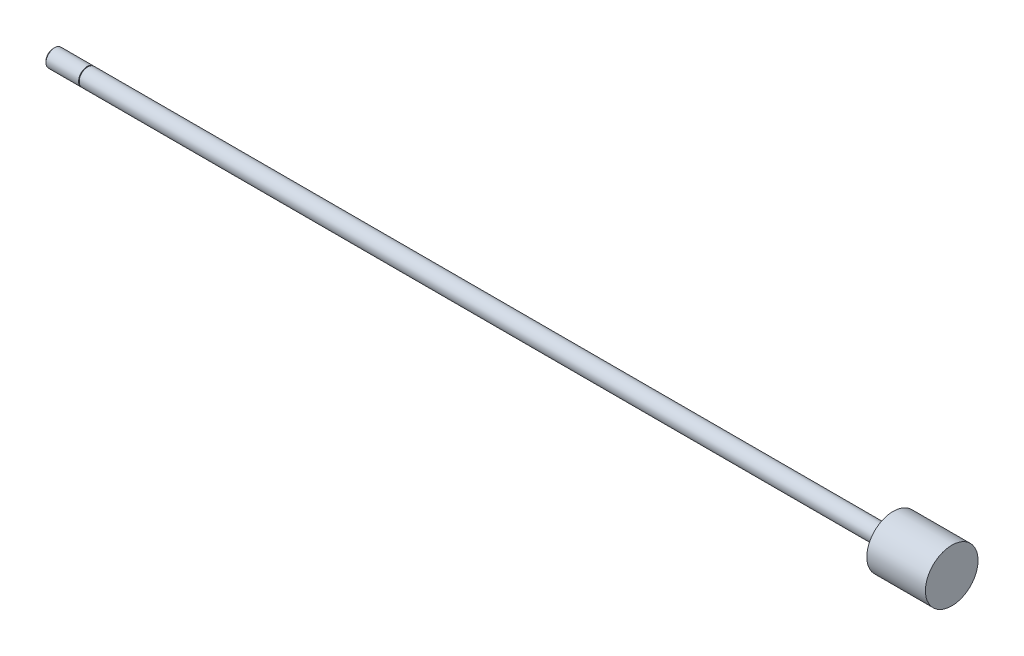
ISO-10303-21;
HEADER;
FILE_DESCRIPTION(('STEP AP214'),'2;1');
FILE_NAME('part.step','',(''),(''),'','','');
FILE_SCHEMA(('AUTOMOTIVE_DESIGN { 1 0 10303 214 1 1 1 1 }'));
ENDSEC;
DATA;
#1=APPLICATION_CONTEXT('core data for automotive mechanical design processes');
#2=APPLICATION_PROTOCOL_DEFINITION('international standard','automotive_design',2000,#1);
#3=PRODUCT_CONTEXT('',#1,'mechanical');
#4=PRODUCT('Part','Part','',(#3));
#5=PRODUCT_RELATED_PRODUCT_CATEGORY('part','',(#4));
#6=PRODUCT_DEFINITION_FORMATION('','',#4);
#7=PRODUCT_DEFINITION_CONTEXT('part definition',#1,'design');
#8=PRODUCT_DEFINITION('design','',#6,#7);
#9=PRODUCT_DEFINITION_SHAPE('','',#8);
#10=(LENGTH_UNIT() NAMED_UNIT(*) SI_UNIT(.MILLI.,.METRE.));
#11=(NAMED_UNIT(*) PLANE_ANGLE_UNIT() SI_UNIT($,.RADIAN.));
#12=(NAMED_UNIT(*) SI_UNIT($,.STERADIAN.) SOLID_ANGLE_UNIT());
#13=UNCERTAINTY_MEASURE_WITH_UNIT(LENGTH_MEASURE(1.E-05),#10,'distance_accuracy_value','');
#14=(GEOMETRIC_REPRESENTATION_CONTEXT(3) GLOBAL_UNCERTAINTY_ASSIGNED_CONTEXT((#13)) GLOBAL_UNIT_ASSIGNED_CONTEXT((#10,
#11,#12)) REPRESENTATION_CONTEXT('',''));
#15=CARTESIAN_POINT('',(0.,0.,0.));
#16=DIRECTION('',(0.,0.,1.));
#17=DIRECTION('',(1.,0.,0.));
#18=AXIS2_PLACEMENT_3D('',#15,#16,#17);
#19=CARTESIAN_POINT('',(315.9252,0.,0.));
#20=DIRECTION('',(-1.,0.,0.));
#21=DIRECTION('',(0.,0.,1.));
#22=AXIS2_PLACEMENT_3D('',#19,#20,#21);
#23=CYLINDRICAL_SURFACE('',#22,3.175);
#24=CARTESIAN_POINT('',(294.4876,0.,0.));
#25=DIRECTION('',(-1.,0.,0.));
#26=DIRECTION('',(0.,0.,1.));
#27=AXIS2_PLACEMENT_3D('',#24,#25,#26);
#28=CIRCLE('',#27,3.175);
#29=CARTESIAN_POINT('',(294.4876,0.,3.175));
#30=VERTEX_POINT('',#29);
#31=EDGE_CURVE('E10',#30,#30,#28,.T.);
#32=ORIENTED_EDGE('',*,*,#31,.T.);
#33=EDGE_LOOP('',(#32));
#34=FACE_BOUND('',#33,.T.);
#35=CARTESIAN_POINT('',(0.,0.,0.));
#36=DIRECTION('',(-1.,0.,0.));
#37=DIRECTION('',(0.,0.,1.));
#38=AXIS2_PLACEMENT_3D('',#35,#36,#37);
#39=CIRCLE('',#38,3.175);
#40=CARTESIAN_POINT('',(0.,0.,3.175));
#41=VERTEX_POINT('',#40);
#42=EDGE_CURVE('E50',#41,#41,#39,.T.);
#43=ORIENTED_EDGE('',*,*,#42,.F.);
#44=EDGE_LOOP('',(#43));
#45=FACE_BOUND('',#44,.T.);
#46=ADVANCED_FACE('F34',(#34,#45),#23,.T.);
#47=CARTESIAN_POINT('',(294.4876,3.175,0.));
#48=DIRECTION('',(1.,0.,0.));
#49=DIRECTION('',(0.,0.,-1.));
#50=AXIS2_PLACEMENT_3D('',#47,#48,#49);
#51=PLANE('',#50);
#52=ORIENTED_EDGE('',*,*,#31,.F.);
#53=EDGE_LOOP('',(#52));
#54=FACE_BOUND('',#53,.T.);
#55=CARTESIAN_POINT('',(294.4876,0.,0.));
#56=DIRECTION('',(-1.,0.,0.));
#57=DIRECTION('',(0.,0.,1.));
#58=AXIS2_PLACEMENT_3D('',#55,#56,#57);
#59=CIRCLE('',#58,9.62025);
#60=CARTESIAN_POINT('',(294.4876,0.,9.62025));
#61=VERTEX_POINT('',#60);
#62=EDGE_CURVE('E42',#61,#61,#59,.T.);
#63=ORIENTED_EDGE('',*,*,#62,.T.);
#64=EDGE_LOOP('',(#63));
#65=FACE_BOUND('',#64,.T.);
#66=ADVANCED_FACE('F84',(#54,#65),#51,.F.);
#67=CARTESIAN_POINT('',(315.9252,0.,0.));
#68=DIRECTION('',(-1.,0.,0.));
#69=DIRECTION('',(0.,0.,1.));
#70=AXIS2_PLACEMENT_3D('',#67,#68,#69);
#71=CYLINDRICAL_SURFACE('',#70,9.62025);
#72=ORIENTED_EDGE('',*,*,#62,.F.);
#73=EDGE_LOOP('',(#72));
#74=FACE_BOUND('',#73,.T.);
#75=CARTESIAN_POINT('',(315.9252,0.,0.));
#76=DIRECTION('',(-1.,0.,0.));
#77=DIRECTION('',(0.,0.,1.));
#78=AXIS2_PLACEMENT_3D('',#75,#76,#77);
#79=CIRCLE('',#78,9.62025);
#80=CARTESIAN_POINT('',(315.9252,0.,9.62025));
#81=VERTEX_POINT('',#80);
#82=EDGE_CURVE('E47',#81,#81,#79,.T.);
#83=ORIENTED_EDGE('',*,*,#82,.T.);
#84=EDGE_LOOP('',(#83));
#85=FACE_BOUND('',#84,.T.);
#86=ADVANCED_FACE('F72',(#74,#85),#71,.T.);
#87=CARTESIAN_POINT('',(315.9252,9.62025,0.));
#88=DIRECTION('',(-1.,0.,0.));
#89=DIRECTION('',(0.,0.,1.));
#90=AXIS2_PLACEMENT_3D('',#87,#88,#89);
#91=PLANE('',#90);
#92=ORIENTED_EDGE('',*,*,#82,.F.);
#93=EDGE_LOOP('',(#92));
#94=FACE_BOUND('',#93,.T.);
#95=ADVANCED_FACE('F74',(#94),#91,.F.);
#96=CARTESIAN_POINT('',(-0.254,3.429,0.));
#97=DIRECTION('',(1.,0.,0.));
#98=DIRECTION('',(0.,0.,-1.));
#99=AXIS2_PLACEMENT_3D('',#96,#97,#98);
#100=PLANE('',#99);
#101=CARTESIAN_POINT('',(-0.254,0.,0.));
#102=DIRECTION('',(-1.,0.,0.));
#103=DIRECTION('',(0.,0.,1.));
#104=AXIS2_PLACEMENT_3D('',#101,#102,#103);
#105=CIRCLE('',#104,2.921);
#106=CARTESIAN_POINT('',(-0.254,0.,2.921));
#107=VERTEX_POINT('',#106);
#108=EDGE_CURVE('E52',#107,#107,#105,.T.);
#109=ORIENTED_EDGE('',*,*,#108,.T.);
#110=EDGE_LOOP('',(#109));
#111=FACE_BOUND('',#110,.T.);
#112=CARTESIAN_POINT('',(-0.253999999999976,0.,0.));
#113=DIRECTION('',(1.,0.,0.));
#114=DIRECTION('',(0.,0.,-1.));
#115=AXIS2_PLACEMENT_3D('',#112,#113,#114);
#116=CIRCLE('',#115,3.175);
#117=CARTESIAN_POINT('',(-0.253999999999976,0.,-3.175));
#118=VERTEX_POINT('',#117);
#119=EDGE_CURVE('E38',#118,#118,#116,.T.);
#120=ORIENTED_EDGE('',*,*,#119,.T.);
#121=EDGE_LOOP('',(#120));
#122=FACE_BOUND('',#121,.T.);
#123=ADVANCED_FACE('F76',(#111,#122),#100,.T.);
#124=CARTESIAN_POINT('',(0.,2.921,0.));
#125=DIRECTION('',(-1.,0.,0.));
#126=DIRECTION('',(0.,0.,1.));
#127=AXIS2_PLACEMENT_3D('',#124,#125,#126);
#128=PLANE('',#127);
#129=CARTESIAN_POINT('',(0.,0.,0.));
#130=DIRECTION('',(-1.,0.,0.));
#131=DIRECTION('',(0.,0.,1.));
#132=AXIS2_PLACEMENT_3D('',#129,#130,#131);
#133=CIRCLE('',#132,2.921);
#134=CARTESIAN_POINT('',(0.,0.,2.921));
#135=VERTEX_POINT('',#134);
#136=EDGE_CURVE('E58',#135,#135,#133,.T.);
#137=ORIENTED_EDGE('',*,*,#136,.F.);
#138=EDGE_LOOP('',(#137));
#139=FACE_BOUND('',#138,.T.);
#140=ORIENTED_EDGE('',*,*,#42,.T.);
#141=EDGE_LOOP('',(#140));
#142=FACE_BOUND('',#141,.T.);
#143=ADVANCED_FACE('F82',(#139,#142),#128,.T.);
#144=CARTESIAN_POINT('',(0.,0.,0.));
#145=DIRECTION('',(-1.,0.,0.));
#146=DIRECTION('',(0.,0.,1.));
#147=AXIS2_PLACEMENT_3D('',#144,#145,#146);
#148=CYLINDRICAL_SURFACE('',#147,2.921);
#149=ORIENTED_EDGE('',*,*,#136,.T.);
#150=EDGE_LOOP('',(#149));
#151=FACE_BOUND('',#150,.T.);
#152=ORIENTED_EDGE('',*,*,#108,.F.);
#153=EDGE_LOOP('',(#152));
#154=FACE_BOUND('',#153,.T.);
#155=ADVANCED_FACE('F111',(#151,#154),#148,.T.);
#156=CARTESIAN_POINT('',(-12.7,0.,0.));
#157=DIRECTION('',(1.,0.,0.));
#158=DIRECTION('',(0.,0.,-1.));
#159=AXIS2_PLACEMENT_3D('',#156,#157,#158);
#160=PLANE('',#159);
#161=CARTESIAN_POINT('',(-12.7,0.,0.));
#162=DIRECTION('',(-1.,0.,0.));
#163=DIRECTION('',(0.,0.,1.));
#164=AXIS2_PLACEMENT_3D('',#161,#162,#163);
#165=CIRCLE('',#164,2.63398);
#166=CARTESIAN_POINT('',(-12.7,0.,2.63398));
#167=VERTEX_POINT('',#166);
#168=EDGE_CURVE('E67',#167,#167,#165,.T.);
#169=ORIENTED_EDGE('',*,*,#168,.T.);
#170=EDGE_LOOP('',(#169));
#171=FACE_BOUND('',#170,.T.);
#172=ADVANCED_FACE('F100',(#171),#160,.F.);
#173=CARTESIAN_POINT('',(-12.15898,0.,0.));
#174=DIRECTION('',(1.,0.,0.));
#175=DIRECTION('',(0.,0.,-1.));
#176=AXIS2_PLACEMENT_3D('',#173,#174,#175);
#177=CONICAL_SURFACE('',#176,3.175,0.785398163397448);
#178=ORIENTED_EDGE('',*,*,#168,.F.);
#179=EDGE_LOOP('',(#178));
#180=FACE_BOUND('',#179,.T.);
#181=CARTESIAN_POINT('',(-12.15898,0.,0.));
#182=DIRECTION('',(-1.,0.,0.));
#183=DIRECTION('',(0.,0.,1.));
#184=AXIS2_PLACEMENT_3D('',#181,#182,#183);
#185=CIRCLE('',#184,3.175);
#186=CARTESIAN_POINT('',(-12.15898,0.,3.175));
#187=VERTEX_POINT('',#186);
#188=EDGE_CURVE('E56',#187,#187,#185,.T.);
#189=ORIENTED_EDGE('',*,*,#188,.T.);
#190=EDGE_LOOP('',(#189));
#191=FACE_BOUND('',#190,.T.);
#192=ADVANCED_FACE('F95',(#180,#191),#177,.T.);
#193=ORIENTED_EDGE('',*,*,#188,.F.);
#194=EDGE_LOOP('',(#193));
#195=FACE_BOUND('',#194,.T.);
#196=ORIENTED_EDGE('',*,*,#119,.F.);
#197=EDGE_LOOP('',(#196));
#198=FACE_BOUND('',#197,.T.);
#199=ADVANCED_FACE('F36',(#195,#198),#23,.T.);
#200=CLOSED_SHELL('',(#46,#66,#86,#95,#123,#143,#155,#172,#192,#199));
#201=MANIFOLD_SOLID_BREP('B2',#200);
#202=ADVANCED_BREP_SHAPE_REPRESENTATION('',(#18,#201),#14);
#203=SHAPE_DEFINITION_REPRESENTATION(#9,#202);
ENDSEC;
END-ISO-10303-21;
